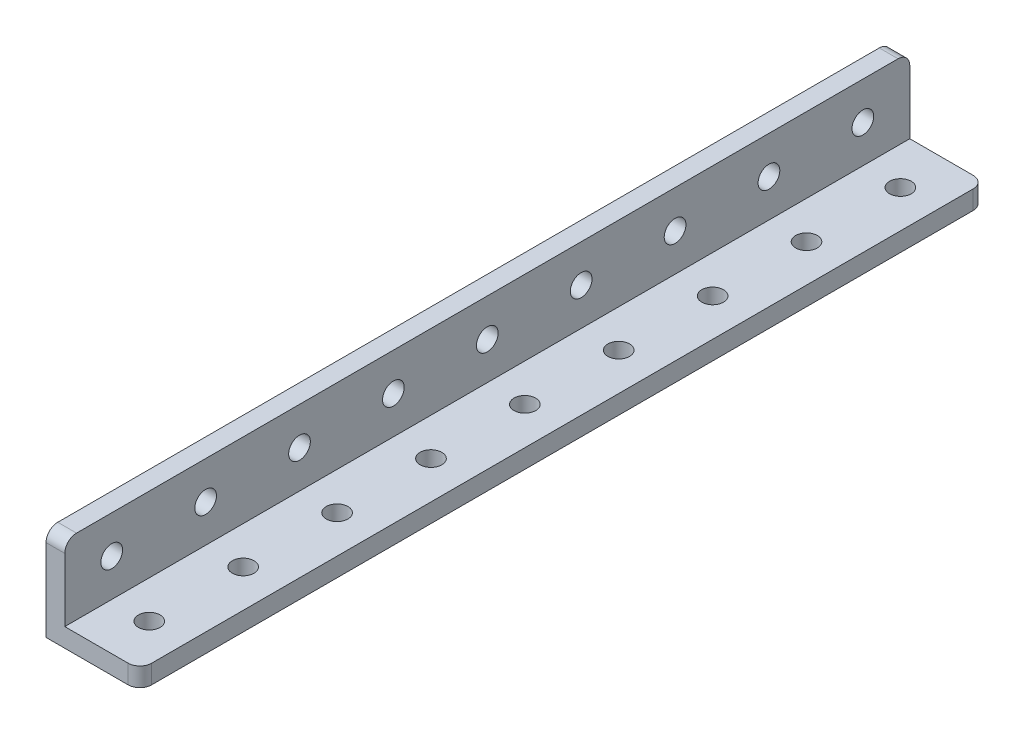
ISO-10303-21;
HEADER;
FILE_DESCRIPTION(('STEP AP214'),'2;1');
FILE_NAME('part.step','',(''),(''),'','','');
FILE_SCHEMA(('AUTOMOTIVE_DESIGN { 1 0 10303 214 1 1 1 1 }'));
ENDSEC;
DATA;
#1=APPLICATION_CONTEXT('core data for automotive mechanical design processes');
#2=APPLICATION_PROTOCOL_DEFINITION('international standard','automotive_design',2000,#1);
#3=PRODUCT_CONTEXT('',#1,'mechanical');
#4=PRODUCT('Part','Part','',(#3));
#5=PRODUCT_RELATED_PRODUCT_CATEGORY('part','',(#4));
#6=PRODUCT_DEFINITION_FORMATION('','',#4);
#7=PRODUCT_DEFINITION_CONTEXT('part definition',#1,'design');
#8=PRODUCT_DEFINITION('design','',#6,#7);
#9=PRODUCT_DEFINITION_SHAPE('','',#8);
#10=(LENGTH_UNIT() NAMED_UNIT(*) SI_UNIT(.MILLI.,.METRE.));
#11=(NAMED_UNIT(*) PLANE_ANGLE_UNIT() SI_UNIT($,.RADIAN.));
#12=(NAMED_UNIT(*) SI_UNIT($,.STERADIAN.) SOLID_ANGLE_UNIT());
#13=UNCERTAINTY_MEASURE_WITH_UNIT(LENGTH_MEASURE(1.E-05),#10,'distance_accuracy_value','');
#14=(GEOMETRIC_REPRESENTATION_CONTEXT(3) GLOBAL_UNCERTAINTY_ASSIGNED_CONTEXT((#13)) GLOBAL_UNIT_ASSIGNED_CONTEXT((#10,
#11,#12)) REPRESENTATION_CONTEXT('',''));
#15=CARTESIAN_POINT('',(0.,0.,0.));
#16=DIRECTION('',(0.,0.,1.));
#17=DIRECTION('',(1.,0.,0.));
#18=AXIS2_PLACEMENT_3D('',#15,#16,#17);
#19=CARTESIAN_POINT('',(0.,16.,0.));
#20=DIRECTION('',(0.,0.,1.));
#21=DIRECTION('',(1.,0.,0.));
#22=AXIS2_PLACEMENT_3D('',#19,#20,#21);
#23=PLANE('',#22);
#24=DIRECTION('',(0.,-1.,0.));
#25=VECTOR('',#24,1.);
#26=CARTESIAN_POINT('',(3.2,16.,0.));
#27=LINE('',#26,#25);
#28=CARTESIAN_POINT('',(3.2,14.,0.));
#29=VERTEX_POINT('',#28);
#30=CARTESIAN_POINT('',(3.2,3.2,0.));
#31=VERTEX_POINT('',#30);
#32=EDGE_CURVE('E126',#29,#31,#27,.T.);
#33=ORIENTED_EDGE('',*,*,#32,.F.);
#34=DIRECTION('',(1.,0.,0.));
#35=VECTOR('',#34,1.);
#36=CARTESIAN_POINT('',(0.,14.,0.));
#37=LINE('',#36,#35);
#38=CARTESIAN_POINT('',(0.,14.,0.));
#39=VERTEX_POINT('',#38);
#40=EDGE_CURVE('E189',#29,#39,#37,.F.);
#41=ORIENTED_EDGE('',*,*,#40,.T.);
#42=DIRECTION('',(0.,-1.,0.));
#43=VECTOR('',#42,1.);
#44=CARTESIAN_POINT('',(0.,16.,0.));
#45=LINE('',#44,#43);
#46=CARTESIAN_POINT('',(0.,0.,0.));
#47=VERTEX_POINT('',#46);
#48=EDGE_CURVE('E147',#39,#47,#45,.T.);
#49=ORIENTED_EDGE('',*,*,#48,.T.);
#50=DIRECTION('',(1.,0.,0.));
#51=VECTOR('',#50,1.);
#52=CARTESIAN_POINT('',(0.,0.,0.));
#53=LINE('',#52,#51);
#54=CARTESIAN_POINT('',(14.,0.,0.));
#55=VERTEX_POINT('',#54);
#56=EDGE_CURVE('E157',#47,#55,#53,.T.);
#57=ORIENTED_EDGE('',*,*,#56,.T.);
#58=DIRECTION('',(0.,-1.,0.));
#59=VECTOR('',#58,1.);
#60=CARTESIAN_POINT('',(14.,16.,0.));
#61=LINE('',#60,#59);
#62=CARTESIAN_POINT('',(14.,3.2,0.));
#63=VERTEX_POINT('',#62);
#64=EDGE_CURVE('E187',#55,#63,#61,.F.);
#65=ORIENTED_EDGE('',*,*,#64,.T.);
#66=DIRECTION('',(1.,0.,0.));
#67=VECTOR('',#66,1.);
#68=CARTESIAN_POINT('',(3.2,3.2,0.));
#69=LINE('',#68,#67);
#70=EDGE_CURVE('E120',#31,#63,#69,.T.);
#71=ORIENTED_EDGE('',*,*,#70,.F.);
#72=EDGE_LOOP('',(#33,#41,#49,#57,#65,#71));
#73=FACE_BOUND('',#72,.T.);
#74=ADVANCED_FACE('F32',(#73),#23,.T.);
#75=CARTESIAN_POINT('',(0.,16.,-144.));
#76=DIRECTION('',(0.,1.,0.));
#77=DIRECTION('',(0.,0.,1.));
#78=AXIS2_PLACEMENT_3D('',#75,#76,#77);
#79=PLANE('',#78);
#80=DIRECTION('',(0.,0.,1.));
#81=VECTOR('',#80,1.);
#82=CARTESIAN_POINT('',(3.2,16.,-144.));
#83=LINE('',#82,#81);
#84=CARTESIAN_POINT('',(3.2,16.,-142.));
#85=VERTEX_POINT('',#84);
#86=CARTESIAN_POINT('',(3.2,16.,-2.));
#87=VERTEX_POINT('',#86);
#88=EDGE_CURVE('E141',#85,#87,#83,.T.);
#89=ORIENTED_EDGE('',*,*,#88,.F.);
#90=DIRECTION('',(1.,0.,0.));
#91=VECTOR('',#90,1.);
#92=CARTESIAN_POINT('',(0.,16.,-142.));
#93=LINE('',#92,#91);
#94=CARTESIAN_POINT('',(0.,16.,-142.));
#95=VERTEX_POINT('',#94);
#96=EDGE_CURVE('E181',#85,#95,#93,.F.);
#97=ORIENTED_EDGE('',*,*,#96,.T.);
#98=DIRECTION('',(0.,0.,1.));
#99=VECTOR('',#98,1.);
#100=CARTESIAN_POINT('',(0.,16.,-144.));
#101=LINE('',#100,#99);
#102=CARTESIAN_POINT('',(0.,16.,-2.));
#103=VERTEX_POINT('',#102);
#104=EDGE_CURVE('E154',#95,#103,#101,.T.);
#105=ORIENTED_EDGE('',*,*,#104,.T.);
#106=DIRECTION('',(1.,0.,0.));
#107=VECTOR('',#106,1.);
#108=CARTESIAN_POINT('',(0.,16.,-2.));
#109=LINE('',#108,#107);
#110=EDGE_CURVE('E178',#103,#87,#109,.T.);
#111=ORIENTED_EDGE('',*,*,#110,.T.);
#112=EDGE_LOOP('',(#89,#97,#105,#111));
#113=FACE_BOUND('',#112,.T.);
#114=ADVANCED_FACE('F220',(#113),#79,.T.);
#115=CARTESIAN_POINT('',(0.,0.,-144.));
#116=DIRECTION('',(0.,0.,-1.));
#117=DIRECTION('',(-1.,0.,0.));
#118=AXIS2_PLACEMENT_3D('',#115,#116,#117);
#119=PLANE('',#118);
#120=DIRECTION('',(0.,1.,0.));
#121=VECTOR('',#120,1.);
#122=CARTESIAN_POINT('',(0.,0.,-144.));
#123=LINE('',#122,#121);
#124=CARTESIAN_POINT('',(0.,0.,-144.));
#125=VERTEX_POINT('',#124);
#126=CARTESIAN_POINT('',(0.,14.,-144.));
#127=VERTEX_POINT('',#126);
#128=EDGE_CURVE('E152',#125,#127,#123,.T.);
#129=ORIENTED_EDGE('',*,*,#128,.T.);
#130=DIRECTION('',(1.,0.,0.));
#131=VECTOR('',#130,1.);
#132=CARTESIAN_POINT('',(0.,14.,-144.));
#133=LINE('',#132,#131);
#134=CARTESIAN_POINT('',(3.2,14.,-144.));
#135=VERTEX_POINT('',#134);
#136=EDGE_CURVE('E118',#127,#135,#133,.T.);
#137=ORIENTED_EDGE('',*,*,#136,.T.);
#138=DIRECTION('',(0.,-1.,0.));
#139=VECTOR('',#138,1.);
#140=CARTESIAN_POINT('',(3.2,16.,-144.));
#141=LINE('',#140,#139);
#142=CARTESIAN_POINT('',(3.2,3.2,-144.));
#143=VERTEX_POINT('',#142);
#144=EDGE_CURVE('E110',#135,#143,#141,.T.);
#145=ORIENTED_EDGE('',*,*,#144,.T.);
#146=DIRECTION('',(1.,0.,0.));
#147=VECTOR('',#146,1.);
#148=CARTESIAN_POINT('',(3.2,3.2,-144.));
#149=LINE('',#148,#147);
#150=CARTESIAN_POINT('',(14.,3.2,-144.));
#151=VERTEX_POINT('',#150);
#152=EDGE_CURVE('E115',#143,#151,#149,.T.);
#153=ORIENTED_EDGE('',*,*,#152,.T.);
#154=DIRECTION('',(0.,1.,0.));
#155=VECTOR('',#154,1.);
#156=CARTESIAN_POINT('',(14.,0.,-144.));
#157=LINE('',#156,#155);
#158=CARTESIAN_POINT('',(14.,0.,-144.));
#159=VERTEX_POINT('',#158);
#160=EDGE_CURVE('E161',#151,#159,#157,.F.);
#161=ORIENTED_EDGE('',*,*,#160,.T.);
#162=DIRECTION('',(1.,0.,0.));
#163=VECTOR('',#162,1.);
#164=CARTESIAN_POINT('',(0.,0.,-144.));
#165=LINE('',#164,#163);
#166=EDGE_CURVE('E159',#125,#159,#165,.T.);
#167=ORIENTED_EDGE('',*,*,#166,.F.);
#168=EDGE_LOOP('',(#129,#137,#145,#153,#161,#167));
#169=FACE_BOUND('',#168,.T.);
#170=ADVANCED_FACE('F113',(#169),#119,.T.);
#171=CARTESIAN_POINT('',(0.,0.,0.));
#172=DIRECTION('',(0.,-1.,0.));
#173=DIRECTION('',(0.,0.,-1.));
#174=AXIS2_PLACEMENT_3D('',#171,#172,#173);
#175=PLANE('',#174);
#176=CARTESIAN_POINT('',(9.6,0.,-24.));
#177=DIRECTION('',(0.,-1.,0.));
#178=DIRECTION('',(0.,0.,-1.));
#179=AXIS2_PLACEMENT_3D('',#176,#177,#178);
#180=CIRCLE('',#179,1.84999999999999);
#181=CARTESIAN_POINT('',(9.6,0.,-25.85));
#182=VERTEX_POINT('',#181);
#183=EDGE_CURVE('E331',#182,#182,#180,.T.);
#184=ORIENTED_EDGE('',*,*,#183,.F.);
#185=EDGE_LOOP('',(#184));
#186=FACE_BOUND('',#185,.T.);
#187=CARTESIAN_POINT('',(9.6,0.,-40.));
#188=DIRECTION('',(0.,-1.,0.));
#189=DIRECTION('',(0.,0.,-1.));
#190=AXIS2_PLACEMENT_3D('',#187,#188,#189);
#191=CIRCLE('',#190,1.84999999999999);
#192=CARTESIAN_POINT('',(9.6,0.,-41.85));
#193=VERTEX_POINT('',#192);
#194=EDGE_CURVE('E335',#193,#193,#191,.T.);
#195=ORIENTED_EDGE('',*,*,#194,.F.);
#196=EDGE_LOOP('',(#195));
#197=FACE_BOUND('',#196,.T.);
#198=CARTESIAN_POINT('',(9.6,0.,-56.));
#199=DIRECTION('',(0.,-1.,0.));
#200=DIRECTION('',(0.,0.,-1.));
#201=AXIS2_PLACEMENT_3D('',#198,#199,#200);
#202=CIRCLE('',#201,1.84999999999999);
#203=CARTESIAN_POINT('',(9.6,0.,-57.85));
#204=VERTEX_POINT('',#203);
#205=EDGE_CURVE('E344',#204,#204,#202,.T.);
#206=ORIENTED_EDGE('',*,*,#205,.F.);
#207=EDGE_LOOP('',(#206));
#208=FACE_BOUND('',#207,.T.);
#209=CARTESIAN_POINT('',(9.6,0.,-72.));
#210=DIRECTION('',(0.,-1.,0.));
#211=DIRECTION('',(0.,0.,-1.));
#212=AXIS2_PLACEMENT_3D('',#209,#210,#211);
#213=CIRCLE('',#212,1.84999999999999);
#214=CARTESIAN_POINT('',(9.6,0.,-73.85));
#215=VERTEX_POINT('',#214);
#216=EDGE_CURVE('E350',#215,#215,#213,.T.);
#217=ORIENTED_EDGE('',*,*,#216,.F.);
#218=EDGE_LOOP('',(#217));
#219=FACE_BOUND('',#218,.T.);
#220=CARTESIAN_POINT('',(9.6,0.,-88.));
#221=DIRECTION('',(0.,-1.,0.));
#222=DIRECTION('',(0.,0.,-1.));
#223=AXIS2_PLACEMENT_3D('',#220,#221,#222);
#224=CIRCLE('',#223,1.84999999999999);
#225=CARTESIAN_POINT('',(9.6,0.,-89.85));
#226=VERTEX_POINT('',#225);
#227=EDGE_CURVE('E356',#226,#226,#224,.T.);
#228=ORIENTED_EDGE('',*,*,#227,.F.);
#229=EDGE_LOOP('',(#228));
#230=FACE_BOUND('',#229,.T.);
#231=CARTESIAN_POINT('',(9.6,0.,-104.));
#232=DIRECTION('',(0.,-1.,0.));
#233=DIRECTION('',(0.,0.,-1.));
#234=AXIS2_PLACEMENT_3D('',#231,#232,#233);
#235=CIRCLE('',#234,1.84999999999999);
#236=CARTESIAN_POINT('',(9.6,0.,-105.85));
#237=VERTEX_POINT('',#236);
#238=EDGE_CURVE('E362',#237,#237,#235,.T.);
#239=ORIENTED_EDGE('',*,*,#238,.F.);
#240=EDGE_LOOP('',(#239));
#241=FACE_BOUND('',#240,.T.);
#242=CARTESIAN_POINT('',(9.6,0.,-120.));
#243=DIRECTION('',(0.,-1.,0.));
#244=DIRECTION('',(0.,0.,-1.));
#245=AXIS2_PLACEMENT_3D('',#242,#243,#244);
#246=CIRCLE('',#245,1.84999999999999);
#247=CARTESIAN_POINT('',(9.6,0.,-121.85));
#248=VERTEX_POINT('',#247);
#249=EDGE_CURVE('E368',#248,#248,#246,.T.);
#250=ORIENTED_EDGE('',*,*,#249,.F.);
#251=EDGE_LOOP('',(#250));
#252=FACE_BOUND('',#251,.T.);
#253=CARTESIAN_POINT('',(9.6,0.,-136.));
#254=DIRECTION('',(0.,-1.,0.));
#255=DIRECTION('',(0.,0.,-1.));
#256=AXIS2_PLACEMENT_3D('',#253,#254,#255);
#257=CIRCLE('',#256,1.84999999999999);
#258=CARTESIAN_POINT('',(9.6,0.,-137.85));
#259=VERTEX_POINT('',#258);
#260=EDGE_CURVE('E374',#259,#259,#257,.T.);
#261=ORIENTED_EDGE('',*,*,#260,.F.);
#262=EDGE_LOOP('',(#261));
#263=FACE_BOUND('',#262,.T.);
#264=CARTESIAN_POINT('',(9.6,0.,-8.));
#265=DIRECTION('',(0.,-1.,0.));
#266=DIRECTION('',(0.,0.,-1.));
#267=AXIS2_PLACEMENT_3D('',#264,#265,#266);
#268=CIRCLE('',#267,1.84999999999999);
#269=CARTESIAN_POINT('',(9.6,0.,-9.84999999999999));
#270=VERTEX_POINT('',#269);
#271=EDGE_CURVE('E380',#270,#270,#268,.T.);
#272=ORIENTED_EDGE('',*,*,#271,.F.);
#273=EDGE_LOOP('',(#272));
#274=FACE_BOUND('',#273,.T.);
#275=ORIENTED_EDGE('',*,*,#166,.T.);
#276=CARTESIAN_POINT('',(14.,0.,-142.));
#277=DIRECTION('',(0.,-1.,0.));
#278=DIRECTION('',(0.,0.,-1.));
#279=AXIS2_PLACEMENT_3D('',#276,#277,#278);
#280=CIRCLE('',#279,2.);
#281=CARTESIAN_POINT('',(16.,0.,-142.));
#282=VERTEX_POINT('',#281);
#283=EDGE_CURVE('E11',#159,#282,#280,.T.);
#284=ORIENTED_EDGE('',*,*,#283,.T.);
#285=DIRECTION('',(0.,0.,-1.));
#286=VECTOR('',#285,1.);
#287=CARTESIAN_POINT('',(16.,0.,0.));
#288=LINE('',#287,#286);
#289=CARTESIAN_POINT('',(16.,0.,-2.));
#290=VERTEX_POINT('',#289);
#291=EDGE_CURVE('E144',#290,#282,#288,.T.);
#292=ORIENTED_EDGE('',*,*,#291,.F.);
#293=CARTESIAN_POINT('',(14.,0.,-2.));
#294=DIRECTION('',(0.,-1.,0.));
#295=DIRECTION('',(0.,0.,-1.));
#296=AXIS2_PLACEMENT_3D('',#293,#294,#295);
#297=CIRCLE('',#296,2.);
#298=EDGE_CURVE('E40',#290,#55,#297,.T.);
#299=ORIENTED_EDGE('',*,*,#298,.T.);
#300=ORIENTED_EDGE('',*,*,#56,.F.);
#301=DIRECTION('',(0.,0.,-1.));
#302=VECTOR('',#301,1.);
#303=CARTESIAN_POINT('',(0.,0.,0.));
#304=LINE('',#303,#302);
#305=EDGE_CURVE('E149',#47,#125,#304,.T.);
#306=ORIENTED_EDGE('',*,*,#305,.T.);
#307=EDGE_LOOP('',(#275,#284,#292,#299,#300,#306));
#308=FACE_BOUND('',#307,.T.);
#309=ADVANCED_FACE('F199',(#186,#197,#208,#219,#230,#241,#252,#263,#274,#308),#175,.T.);
#310=CARTESIAN_POINT('',(0.,0.,0.));
#311=DIRECTION('',(1.,0.,0.));
#312=DIRECTION('',(0.,0.,-1.));
#313=AXIS2_PLACEMENT_3D('',#310,#311,#312);
#314=PLANE('',#313);
#315=CARTESIAN_POINT('',(0.,9.6,-24.));
#316=DIRECTION('',(-1.,0.,0.));
#317=DIRECTION('',(0.,0.,1.));
#318=AXIS2_PLACEMENT_3D('',#315,#316,#317);
#319=CIRCLE('',#318,1.84999999999999);
#320=CARTESIAN_POINT('',(0.,9.6,-22.15));
#321=VERTEX_POINT('',#320);
#322=EDGE_CURVE('E386',#321,#321,#319,.T.);
#323=ORIENTED_EDGE('',*,*,#322,.F.);
#324=EDGE_LOOP('',(#323));
#325=FACE_BOUND('',#324,.T.);
#326=CARTESIAN_POINT('',(0.,9.6,-40.));
#327=DIRECTION('',(-1.,0.,0.));
#328=DIRECTION('',(0.,0.,1.));
#329=AXIS2_PLACEMENT_3D('',#326,#327,#328);
#330=CIRCLE('',#329,1.84999999999999);
#331=CARTESIAN_POINT('',(0.,9.6,-38.15));
#332=VERTEX_POINT('',#331);
#333=EDGE_CURVE('E392',#332,#332,#330,.T.);
#334=ORIENTED_EDGE('',*,*,#333,.F.);
#335=EDGE_LOOP('',(#334));
#336=FACE_BOUND('',#335,.T.);
#337=CARTESIAN_POINT('',(0.,9.6,-56.));
#338=DIRECTION('',(-1.,0.,0.));
#339=DIRECTION('',(0.,0.,1.));
#340=AXIS2_PLACEMENT_3D('',#337,#338,#339);
#341=CIRCLE('',#340,1.84999999999999);
#342=CARTESIAN_POINT('',(0.,9.6,-54.15));
#343=VERTEX_POINT('',#342);
#344=EDGE_CURVE('E398',#343,#343,#341,.T.);
#345=ORIENTED_EDGE('',*,*,#344,.F.);
#346=EDGE_LOOP('',(#345));
#347=FACE_BOUND('',#346,.T.);
#348=CARTESIAN_POINT('',(0.,9.6,-72.));
#349=DIRECTION('',(-1.,0.,0.));
#350=DIRECTION('',(0.,0.,1.));
#351=AXIS2_PLACEMENT_3D('',#348,#349,#350);
#352=CIRCLE('',#351,1.84999999999999);
#353=CARTESIAN_POINT('',(0.,9.6,-70.15));
#354=VERTEX_POINT('',#353);
#355=EDGE_CURVE('E171',#354,#354,#352,.T.);
#356=ORIENTED_EDGE('',*,*,#355,.F.);
#357=EDGE_LOOP('',(#356));
#358=FACE_BOUND('',#357,.T.);
#359=CARTESIAN_POINT('',(0.,9.6,-88.));
#360=DIRECTION('',(-1.,0.,0.));
#361=DIRECTION('',(0.,0.,1.));
#362=AXIS2_PLACEMENT_3D('',#359,#360,#361);
#363=CIRCLE('',#362,1.84999999999999);
#364=CARTESIAN_POINT('',(0.,9.6,-86.15));
#365=VERTEX_POINT('',#364);
#366=EDGE_CURVE('E170',#365,#365,#363,.T.);
#367=ORIENTED_EDGE('',*,*,#366,.F.);
#368=EDGE_LOOP('',(#367));
#369=FACE_BOUND('',#368,.T.);
#370=CARTESIAN_POINT('',(0.,9.6,-104.));
#371=DIRECTION('',(-1.,0.,0.));
#372=DIRECTION('',(0.,0.,1.));
#373=AXIS2_PLACEMENT_3D('',#370,#371,#372);
#374=CIRCLE('',#373,1.84999999999999);
#375=CARTESIAN_POINT('',(0.,9.6,-102.15));
#376=VERTEX_POINT('',#375);
#377=EDGE_CURVE('E411',#376,#376,#374,.T.);
#378=ORIENTED_EDGE('',*,*,#377,.F.);
#379=EDGE_LOOP('',(#378));
#380=FACE_BOUND('',#379,.T.);
#381=CARTESIAN_POINT('',(0.,9.6,-120.));
#382=DIRECTION('',(-1.,0.,0.));
#383=DIRECTION('',(0.,0.,1.));
#384=AXIS2_PLACEMENT_3D('',#381,#382,#383);
#385=CIRCLE('',#384,1.84999999999999);
#386=CARTESIAN_POINT('',(0.,9.6,-118.15));
#387=VERTEX_POINT('',#386);
#388=EDGE_CURVE('E417',#387,#387,#385,.T.);
#389=ORIENTED_EDGE('',*,*,#388,.F.);
#390=EDGE_LOOP('',(#389));
#391=FACE_BOUND('',#390,.T.);
#392=CARTESIAN_POINT('',(0.,9.6,-136.));
#393=DIRECTION('',(-1.,0.,0.));
#394=DIRECTION('',(0.,0.,1.));
#395=AXIS2_PLACEMENT_3D('',#392,#393,#394);
#396=CIRCLE('',#395,1.84999999999999);
#397=CARTESIAN_POINT('',(0.,9.6,-134.15));
#398=VERTEX_POINT('',#397);
#399=EDGE_CURVE('E423',#398,#398,#396,.T.);
#400=ORIENTED_EDGE('',*,*,#399,.F.);
#401=EDGE_LOOP('',(#400));
#402=FACE_BOUND('',#401,.T.);
#403=CARTESIAN_POINT('',(0.,9.6,-8.));
#404=DIRECTION('',(-1.,0.,0.));
#405=DIRECTION('',(0.,0.,1.));
#406=AXIS2_PLACEMENT_3D('',#403,#404,#405);
#407=CIRCLE('',#406,1.84999999999999);
#408=CARTESIAN_POINT('',(0.,9.6,-6.15000000000001));
#409=VERTEX_POINT('',#408);
#410=EDGE_CURVE('E166',#409,#409,#407,.T.);
#411=ORIENTED_EDGE('',*,*,#410,.F.);
#412=EDGE_LOOP('',(#411));
#413=FACE_BOUND('',#412,.T.);
#414=ORIENTED_EDGE('',*,*,#104,.F.);
#415=CARTESIAN_POINT('',(0.,14.,-142.));
#416=DIRECTION('',(1.,0.,0.));
#417=DIRECTION('',(0.,0.,-1.));
#418=AXIS2_PLACEMENT_3D('',#415,#416,#417);
#419=CIRCLE('',#418,2.);
#420=EDGE_CURVE('E185',#95,#127,#419,.F.);
#421=ORIENTED_EDGE('',*,*,#420,.T.);
#422=ORIENTED_EDGE('',*,*,#128,.F.);
#423=ORIENTED_EDGE('',*,*,#305,.F.);
#424=ORIENTED_EDGE('',*,*,#48,.F.);
#425=CARTESIAN_POINT('',(0.,14.,-2.));
#426=DIRECTION('',(1.,0.,0.));
#427=DIRECTION('',(0.,0.,-1.));
#428=AXIS2_PLACEMENT_3D('',#425,#426,#427);
#429=CIRCLE('',#428,2.);
#430=EDGE_CURVE('E183',#39,#103,#429,.F.);
#431=ORIENTED_EDGE('',*,*,#430,.T.);
#432=EDGE_LOOP('',(#414,#421,#422,#423,#424,#431));
#433=FACE_BOUND('',#432,.T.);
#434=ADVANCED_FACE('F212',(#325,#336,#347,#358,#369,#380,#391,#402,#413,#433),#314,.F.);
#435=CARTESIAN_POINT('',(16.,0.,0.));
#436=DIRECTION('',(1.,0.,0.));
#437=DIRECTION('',(0.,0.,-1.));
#438=AXIS2_PLACEMENT_3D('',#435,#436,#437);
#439=PLANE('',#438);
#440=ORIENTED_EDGE('',*,*,#291,.T.);
#441=DIRECTION('',(0.,1.,0.));
#442=VECTOR('',#441,1.);
#443=CARTESIAN_POINT('',(16.,0.,-142.));
#444=LINE('',#443,#442);
#445=CARTESIAN_POINT('',(16.,3.2,-142.));
#446=VERTEX_POINT('',#445);
#447=EDGE_CURVE('E193',#282,#446,#444,.T.);
#448=ORIENTED_EDGE('',*,*,#447,.T.);
#449=DIRECTION('',(0.,0.,1.));
#450=VECTOR('',#449,1.);
#451=CARTESIAN_POINT('',(16.,3.2,-144.));
#452=LINE('',#451,#450);
#453=CARTESIAN_POINT('',(16.,3.2,-2.));
#454=VERTEX_POINT('',#453);
#455=EDGE_CURVE('E130',#446,#454,#452,.T.);
#456=ORIENTED_EDGE('',*,*,#455,.T.);
#457=DIRECTION('',(0.,-1.,0.));
#458=VECTOR('',#457,1.);
#459=CARTESIAN_POINT('',(16.,0.,-2.));
#460=LINE('',#459,#458);
#461=EDGE_CURVE('E191',#454,#290,#460,.T.);
#462=ORIENTED_EDGE('',*,*,#461,.T.);
#463=EDGE_LOOP('',(#440,#448,#456,#462));
#464=FACE_BOUND('',#463,.T.);
#465=ADVANCED_FACE('F205',(#464),#439,.T.);
#466=CARTESIAN_POINT('',(3.2,16.,-144.));
#467=DIRECTION('',(-1.,0.,0.));
#468=DIRECTION('',(0.,-1.,0.));
#469=AXIS2_PLACEMENT_3D('',#466,#467,#468);
#470=PLANE('',#469);
#471=CARTESIAN_POINT('',(3.2,9.6,-24.));
#472=DIRECTION('',(-1.,0.,0.));
#473=DIRECTION('',(0.,-1.,0.));
#474=AXIS2_PLACEMENT_3D('',#471,#472,#473);
#475=CIRCLE('',#474,1.84999999999999);
#476=CARTESIAN_POINT('',(3.2,7.75000000000001,-24.));
#477=VERTEX_POINT('',#476);
#478=EDGE_CURVE('E389',#477,#477,#475,.T.);
#479=ORIENTED_EDGE('',*,*,#478,.T.);
#480=EDGE_LOOP('',(#479));
#481=FACE_BOUND('',#480,.T.);
#482=CARTESIAN_POINT('',(3.2,9.6,-40.));
#483=DIRECTION('',(-1.,0.,0.));
#484=DIRECTION('',(0.,-1.,0.));
#485=AXIS2_PLACEMENT_3D('',#482,#483,#484);
#486=CIRCLE('',#485,1.84999999999999);
#487=CARTESIAN_POINT('',(3.2,7.75000000000001,-40.));
#488=VERTEX_POINT('',#487);
#489=EDGE_CURVE('E395',#488,#488,#486,.T.);
#490=ORIENTED_EDGE('',*,*,#489,.T.);
#491=EDGE_LOOP('',(#490));
#492=FACE_BOUND('',#491,.T.);
#493=CARTESIAN_POINT('',(3.2,9.6,-56.));
#494=DIRECTION('',(-1.,0.,0.));
#495=DIRECTION('',(0.,-1.,0.));
#496=AXIS2_PLACEMENT_3D('',#493,#494,#495);
#497=CIRCLE('',#496,1.84999999999999);
#498=CARTESIAN_POINT('',(3.2,7.75000000000001,-56.));
#499=VERTEX_POINT('',#498);
#500=EDGE_CURVE('E401',#499,#499,#497,.T.);
#501=ORIENTED_EDGE('',*,*,#500,.T.);
#502=EDGE_LOOP('',(#501));
#503=FACE_BOUND('',#502,.T.);
#504=CARTESIAN_POINT('',(3.2,9.6,-72.));
#505=DIRECTION('',(-1.,0.,0.));
#506=DIRECTION('',(0.,-1.,0.));
#507=AXIS2_PLACEMENT_3D('',#504,#505,#506);
#508=CIRCLE('',#507,1.84999999999999);
#509=CARTESIAN_POINT('',(3.2,7.75000000000001,-72.));
#510=VERTEX_POINT('',#509);
#511=EDGE_CURVE('E167',#510,#510,#508,.T.);
#512=ORIENTED_EDGE('',*,*,#511,.T.);
#513=EDGE_LOOP('',(#512));
#514=FACE_BOUND('',#513,.T.);
#515=CARTESIAN_POINT('',(3.2,9.6,-88.));
#516=DIRECTION('',(-1.,0.,0.));
#517=DIRECTION('',(0.,-1.,0.));
#518=AXIS2_PLACEMENT_3D('',#515,#516,#517);
#519=CIRCLE('',#518,1.84999999999999);
#520=CARTESIAN_POINT('',(3.2,7.75000000000001,-88.));
#521=VERTEX_POINT('',#520);
#522=EDGE_CURVE('E408',#521,#521,#519,.T.);
#523=ORIENTED_EDGE('',*,*,#522,.T.);
#524=EDGE_LOOP('',(#523));
#525=FACE_BOUND('',#524,.T.);
#526=CARTESIAN_POINT('',(3.2,9.6,-104.));
#527=DIRECTION('',(-1.,0.,0.));
#528=DIRECTION('',(0.,-1.,0.));
#529=AXIS2_PLACEMENT_3D('',#526,#527,#528);
#530=CIRCLE('',#529,1.84999999999999);
#531=CARTESIAN_POINT('',(3.2,7.75000000000001,-104.));
#532=VERTEX_POINT('',#531);
#533=EDGE_CURVE('E414',#532,#532,#530,.T.);
#534=ORIENTED_EDGE('',*,*,#533,.T.);
#535=EDGE_LOOP('',(#534));
#536=FACE_BOUND('',#535,.T.);
#537=CARTESIAN_POINT('',(3.2,9.6,-120.));
#538=DIRECTION('',(-1.,0.,0.));
#539=DIRECTION('',(0.,-1.,0.));
#540=AXIS2_PLACEMENT_3D('',#537,#538,#539);
#541=CIRCLE('',#540,1.84999999999999);
#542=CARTESIAN_POINT('',(3.2,7.75000000000001,-120.));
#543=VERTEX_POINT('',#542);
#544=EDGE_CURVE('E420',#543,#543,#541,.T.);
#545=ORIENTED_EDGE('',*,*,#544,.T.);
#546=EDGE_LOOP('',(#545));
#547=FACE_BOUND('',#546,.T.);
#548=CARTESIAN_POINT('',(3.2,9.6,-136.));
#549=DIRECTION('',(-1.,0.,0.));
#550=DIRECTION('',(0.,-1.,0.));
#551=AXIS2_PLACEMENT_3D('',#548,#549,#550);
#552=CIRCLE('',#551,1.84999999999999);
#553=CARTESIAN_POINT('',(3.2,7.75000000000001,-136.));
#554=VERTEX_POINT('',#553);
#555=EDGE_CURVE('E426',#554,#554,#552,.T.);
#556=ORIENTED_EDGE('',*,*,#555,.T.);
#557=EDGE_LOOP('',(#556));
#558=FACE_BOUND('',#557,.T.);
#559=CARTESIAN_POINT('',(3.2,9.6,-8.));
#560=DIRECTION('',(-1.,0.,0.));
#561=DIRECTION('',(0.,-1.,0.));
#562=AXIS2_PLACEMENT_3D('',#559,#560,#561);
#563=CIRCLE('',#562,1.84999999999999);
#564=CARTESIAN_POINT('',(3.2,7.75000000000001,-8.));
#565=VERTEX_POINT('',#564);
#566=EDGE_CURVE('E139',#565,#565,#563,.T.);
#567=ORIENTED_EDGE('',*,*,#566,.T.);
#568=EDGE_LOOP('',(#567));
#569=FACE_BOUND('',#568,.T.);
#570=ORIENTED_EDGE('',*,*,#144,.F.);
#571=CARTESIAN_POINT('',(3.2,14.,-142.));
#572=DIRECTION('',(-1.,0.,0.));
#573=DIRECTION('',(0.,-1.,0.));
#574=AXIS2_PLACEMENT_3D('',#571,#572,#573);
#575=CIRCLE('',#574,2.);
#576=EDGE_CURVE('E176',#135,#85,#575,.F.);
#577=ORIENTED_EDGE('',*,*,#576,.T.);
#578=ORIENTED_EDGE('',*,*,#88,.T.);
#579=CARTESIAN_POINT('',(3.2,14.,-2.));
#580=DIRECTION('',(-1.,0.,0.));
#581=DIRECTION('',(0.,-1.,0.));
#582=AXIS2_PLACEMENT_3D('',#579,#580,#581);
#583=CIRCLE('',#582,2.);
#584=EDGE_CURVE('E174',#87,#29,#583,.F.);
#585=ORIENTED_EDGE('',*,*,#584,.T.);
#586=ORIENTED_EDGE('',*,*,#32,.T.);
#587=DIRECTION('',(0.,0.,1.));
#588=VECTOR('',#587,1.);
#589=CARTESIAN_POINT('',(3.2,3.2,-144.));
#590=LINE('',#589,#588);
#591=EDGE_CURVE('E123',#143,#31,#590,.T.);
#592=ORIENTED_EDGE('',*,*,#591,.F.);
#593=EDGE_LOOP('',(#570,#577,#578,#585,#586,#592));
#594=FACE_BOUND('',#593,.T.);
#595=ADVANCED_FACE('F124',(#481,#492,#503,#514,#525,#536,#547,#558,#569,#594),#470,.F.);
#596=CARTESIAN_POINT('',(3.2,3.2,-144.));
#597=DIRECTION('',(0.,-1.,0.));
#598=DIRECTION('',(0.,0.,-1.));
#599=AXIS2_PLACEMENT_3D('',#596,#597,#598);
#600=PLANE('',#599);
#601=CARTESIAN_POINT('',(9.6,3.2,-24.));
#602=DIRECTION('',(0.,-1.,0.));
#603=DIRECTION('',(0.,0.,-1.));
#604=AXIS2_PLACEMENT_3D('',#601,#602,#603);
#605=CIRCLE('',#604,1.84999999999999);
#606=CARTESIAN_POINT('',(9.6,3.2,-25.85));
#607=VERTEX_POINT('',#606);
#608=EDGE_CURVE('E334',#607,#607,#605,.T.);
#609=ORIENTED_EDGE('',*,*,#608,.T.);
#610=EDGE_LOOP('',(#609));
#611=FACE_BOUND('',#610,.T.);
#612=CARTESIAN_POINT('',(9.6,3.2,-40.));
#613=DIRECTION('',(0.,-1.,0.));
#614=DIRECTION('',(0.,0.,-1.));
#615=AXIS2_PLACEMENT_3D('',#612,#613,#614);
#616=CIRCLE('',#615,1.84999999999999);
#617=CARTESIAN_POINT('',(9.6,3.2,-41.85));
#618=VERTEX_POINT('',#617);
#619=EDGE_CURVE('E338',#618,#618,#616,.T.);
#620=ORIENTED_EDGE('',*,*,#619,.T.);
#621=EDGE_LOOP('',(#620));
#622=FACE_BOUND('',#621,.T.);
#623=CARTESIAN_POINT('',(9.6,3.2,-56.));
#624=DIRECTION('',(0.,-1.,0.));
#625=DIRECTION('',(0.,0.,-1.));
#626=AXIS2_PLACEMENT_3D('',#623,#624,#625);
#627=CIRCLE('',#626,1.84999999999999);
#628=CARTESIAN_POINT('',(9.6,3.2,-57.85));
#629=VERTEX_POINT('',#628);
#630=EDGE_CURVE('E347',#629,#629,#627,.T.);
#631=ORIENTED_EDGE('',*,*,#630,.T.);
#632=EDGE_LOOP('',(#631));
#633=FACE_BOUND('',#632,.T.);
#634=CARTESIAN_POINT('',(9.6,3.2,-72.));
#635=DIRECTION('',(0.,-1.,0.));
#636=DIRECTION('',(0.,0.,-1.));
#637=AXIS2_PLACEMENT_3D('',#634,#635,#636);
#638=CIRCLE('',#637,1.84999999999999);
#639=CARTESIAN_POINT('',(9.6,3.2,-73.85));
#640=VERTEX_POINT('',#639);
#641=EDGE_CURVE('E353',#640,#640,#638,.T.);
#642=ORIENTED_EDGE('',*,*,#641,.T.);
#643=EDGE_LOOP('',(#642));
#644=FACE_BOUND('',#643,.T.);
#645=CARTESIAN_POINT('',(9.6,3.2,-88.));
#646=DIRECTION('',(0.,-1.,0.));
#647=DIRECTION('',(0.,0.,-1.));
#648=AXIS2_PLACEMENT_3D('',#645,#646,#647);
#649=CIRCLE('',#648,1.84999999999999);
#650=CARTESIAN_POINT('',(9.6,3.2,-89.85));
#651=VERTEX_POINT('',#650);
#652=EDGE_CURVE('E359',#651,#651,#649,.T.);
#653=ORIENTED_EDGE('',*,*,#652,.T.);
#654=EDGE_LOOP('',(#653));
#655=FACE_BOUND('',#654,.T.);
#656=CARTESIAN_POINT('',(9.6,3.2,-104.));
#657=DIRECTION('',(0.,-1.,0.));
#658=DIRECTION('',(0.,0.,-1.));
#659=AXIS2_PLACEMENT_3D('',#656,#657,#658);
#660=CIRCLE('',#659,1.84999999999999);
#661=CARTESIAN_POINT('',(9.6,3.2,-105.85));
#662=VERTEX_POINT('',#661);
#663=EDGE_CURVE('E365',#662,#662,#660,.T.);
#664=ORIENTED_EDGE('',*,*,#663,.T.);
#665=EDGE_LOOP('',(#664));
#666=FACE_BOUND('',#665,.T.);
#667=CARTESIAN_POINT('',(9.6,3.2,-120.));
#668=DIRECTION('',(0.,-1.,0.));
#669=DIRECTION('',(0.,0.,-1.));
#670=AXIS2_PLACEMENT_3D('',#667,#668,#669);
#671=CIRCLE('',#670,1.84999999999999);
#672=CARTESIAN_POINT('',(9.6,3.2,-121.85));
#673=VERTEX_POINT('',#672);
#674=EDGE_CURVE('E371',#673,#673,#671,.T.);
#675=ORIENTED_EDGE('',*,*,#674,.T.);
#676=EDGE_LOOP('',(#675));
#677=FACE_BOUND('',#676,.T.);
#678=CARTESIAN_POINT('',(9.6,3.2,-136.));
#679=DIRECTION('',(0.,-1.,0.));
#680=DIRECTION('',(0.,0.,-1.));
#681=AXIS2_PLACEMENT_3D('',#678,#679,#680);
#682=CIRCLE('',#681,1.84999999999999);
#683=CARTESIAN_POINT('',(9.6,3.2,-137.85));
#684=VERTEX_POINT('',#683);
#685=EDGE_CURVE('E377',#684,#684,#682,.T.);
#686=ORIENTED_EDGE('',*,*,#685,.T.);
#687=EDGE_LOOP('',(#686));
#688=FACE_BOUND('',#687,.T.);
#689=CARTESIAN_POINT('',(9.6,3.2,-8.));
#690=DIRECTION('',(0.,-1.,0.));
#691=DIRECTION('',(0.,0.,-1.));
#692=AXIS2_PLACEMENT_3D('',#689,#690,#691);
#693=CIRCLE('',#692,1.84999999999999);
#694=CARTESIAN_POINT('',(9.6,3.2,-9.84999999999999));
#695=VERTEX_POINT('',#694);
#696=EDGE_CURVE('E383',#695,#695,#693,.T.);
#697=ORIENTED_EDGE('',*,*,#696,.T.);
#698=EDGE_LOOP('',(#697));
#699=FACE_BOUND('',#698,.T.);
#700=ORIENTED_EDGE('',*,*,#455,.F.);
#701=CARTESIAN_POINT('',(14.,3.2,-142.));
#702=DIRECTION('',(0.,-1.,0.));
#703=DIRECTION('',(0.,0.,-1.));
#704=AXIS2_PLACEMENT_3D('',#701,#702,#703);
#705=CIRCLE('',#704,2.);
#706=EDGE_CURVE('E134',#446,#151,#705,.F.);
#707=ORIENTED_EDGE('',*,*,#706,.T.);
#708=ORIENTED_EDGE('',*,*,#152,.F.);
#709=ORIENTED_EDGE('',*,*,#591,.T.);
#710=ORIENTED_EDGE('',*,*,#70,.T.);
#711=CARTESIAN_POINT('',(14.,3.2,-2.));
#712=DIRECTION('',(0.,-1.,0.));
#713=DIRECTION('',(0.,0.,-1.));
#714=AXIS2_PLACEMENT_3D('',#711,#712,#713);
#715=CIRCLE('',#714,2.);
#716=EDGE_CURVE('E196',#63,#454,#715,.F.);
#717=ORIENTED_EDGE('',*,*,#716,.T.);
#718=EDGE_LOOP('',(#700,#707,#708,#709,#710,#717));
#719=FACE_BOUND('',#718,.T.);
#720=ADVANCED_FACE('F133',(#611,#622,#633,#644,#655,#666,#677,#688,#699,#719),#600,.F.);
#721=CARTESIAN_POINT('',(0.,9.6,-8.));
#722=DIRECTION('',(-1.,0.,0.));
#723=DIRECTION('',(0.,0.,1.));
#724=AXIS2_PLACEMENT_3D('',#721,#722,#723);
#725=CYLINDRICAL_SURFACE('',#724,1.84999999999999);
#726=ORIENTED_EDGE('',*,*,#410,.T.);
#727=EDGE_LOOP('',(#726));
#728=FACE_BOUND('',#727,.T.);
#729=ORIENTED_EDGE('',*,*,#566,.F.);
#730=EDGE_LOOP('',(#729));
#731=FACE_BOUND('',#730,.T.);
#732=ADVANCED_FACE('F255',(#728,#731),#725,.F.);
#733=CARTESIAN_POINT('',(0.,9.6,-136.));
#734=DIRECTION('',(-1.,0.,0.));
#735=DIRECTION('',(0.,0.,1.));
#736=AXIS2_PLACEMENT_3D('',#733,#734,#735);
#737=CYLINDRICAL_SURFACE('',#736,1.84999999999999);
#738=ORIENTED_EDGE('',*,*,#399,.T.);
#739=EDGE_LOOP('',(#738));
#740=FACE_BOUND('',#739,.T.);
#741=ORIENTED_EDGE('',*,*,#555,.F.);
#742=EDGE_LOOP('',(#741));
#743=FACE_BOUND('',#742,.T.);
#744=ADVANCED_FACE('F259',(#740,#743),#737,.F.);
#745=CARTESIAN_POINT('',(0.,9.6,-120.));
#746=DIRECTION('',(-1.,0.,0.));
#747=DIRECTION('',(0.,0.,1.));
#748=AXIS2_PLACEMENT_3D('',#745,#746,#747);
#749=CYLINDRICAL_SURFACE('',#748,1.84999999999999);
#750=ORIENTED_EDGE('',*,*,#388,.T.);
#751=EDGE_LOOP('',(#750));
#752=FACE_BOUND('',#751,.T.);
#753=ORIENTED_EDGE('',*,*,#544,.F.);
#754=EDGE_LOOP('',(#753));
#755=FACE_BOUND('',#754,.T.);
#756=ADVANCED_FACE('F263',(#752,#755),#749,.F.);
#757=CARTESIAN_POINT('',(0.,9.6,-104.));
#758=DIRECTION('',(-1.,0.,0.));
#759=DIRECTION('',(0.,0.,1.));
#760=AXIS2_PLACEMENT_3D('',#757,#758,#759);
#761=CYLINDRICAL_SURFACE('',#760,1.84999999999999);
#762=ORIENTED_EDGE('',*,*,#377,.T.);
#763=EDGE_LOOP('',(#762));
#764=FACE_BOUND('',#763,.T.);
#765=ORIENTED_EDGE('',*,*,#533,.F.);
#766=EDGE_LOOP('',(#765));
#767=FACE_BOUND('',#766,.T.);
#768=ADVANCED_FACE('F267',(#764,#767),#761,.F.);
#769=CARTESIAN_POINT('',(0.,9.6,-88.));
#770=DIRECTION('',(-1.,0.,0.));
#771=DIRECTION('',(0.,0.,1.));
#772=AXIS2_PLACEMENT_3D('',#769,#770,#771);
#773=CYLINDRICAL_SURFACE('',#772,1.84999999999999);
#774=ORIENTED_EDGE('',*,*,#366,.T.);
#775=EDGE_LOOP('',(#774));
#776=FACE_BOUND('',#775,.T.);
#777=ORIENTED_EDGE('',*,*,#522,.F.);
#778=EDGE_LOOP('',(#777));
#779=FACE_BOUND('',#778,.T.);
#780=ADVANCED_FACE('F271',(#776,#779),#773,.F.);
#781=CARTESIAN_POINT('',(0.,9.6,-72.));
#782=DIRECTION('',(-1.,0.,0.));
#783=DIRECTION('',(0.,0.,1.));
#784=AXIS2_PLACEMENT_3D('',#781,#782,#783);
#785=CYLINDRICAL_SURFACE('',#784,1.84999999999999);
#786=ORIENTED_EDGE('',*,*,#355,.T.);
#787=EDGE_LOOP('',(#786));
#788=FACE_BOUND('',#787,.T.);
#789=ORIENTED_EDGE('',*,*,#511,.F.);
#790=EDGE_LOOP('',(#789));
#791=FACE_BOUND('',#790,.T.);
#792=ADVANCED_FACE('F275',(#788,#791),#785,.F.);
#793=CARTESIAN_POINT('',(0.,9.6,-56.));
#794=DIRECTION('',(-1.,0.,0.));
#795=DIRECTION('',(0.,0.,1.));
#796=AXIS2_PLACEMENT_3D('',#793,#794,#795);
#797=CYLINDRICAL_SURFACE('',#796,1.84999999999999);
#798=ORIENTED_EDGE('',*,*,#344,.T.);
#799=EDGE_LOOP('',(#798));
#800=FACE_BOUND('',#799,.T.);
#801=ORIENTED_EDGE('',*,*,#500,.F.);
#802=EDGE_LOOP('',(#801));
#803=FACE_BOUND('',#802,.T.);
#804=ADVANCED_FACE('F279',(#800,#803),#797,.F.);
#805=CARTESIAN_POINT('',(0.,9.6,-40.));
#806=DIRECTION('',(-1.,0.,0.));
#807=DIRECTION('',(0.,0.,1.));
#808=AXIS2_PLACEMENT_3D('',#805,#806,#807);
#809=CYLINDRICAL_SURFACE('',#808,1.84999999999999);
#810=ORIENTED_EDGE('',*,*,#333,.T.);
#811=EDGE_LOOP('',(#810));
#812=FACE_BOUND('',#811,.T.);
#813=ORIENTED_EDGE('',*,*,#489,.F.);
#814=EDGE_LOOP('',(#813));
#815=FACE_BOUND('',#814,.T.);
#816=ADVANCED_FACE('F283',(#812,#815),#809,.F.);
#817=CARTESIAN_POINT('',(0.,9.6,-24.));
#818=DIRECTION('',(-1.,0.,0.));
#819=DIRECTION('',(0.,0.,1.));
#820=AXIS2_PLACEMENT_3D('',#817,#818,#819);
#821=CYLINDRICAL_SURFACE('',#820,1.84999999999999);
#822=ORIENTED_EDGE('',*,*,#322,.T.);
#823=EDGE_LOOP('',(#822));
#824=FACE_BOUND('',#823,.T.);
#825=ORIENTED_EDGE('',*,*,#478,.F.);
#826=EDGE_LOOP('',(#825));
#827=FACE_BOUND('',#826,.T.);
#828=ADVANCED_FACE('F287',(#824,#827),#821,.F.);
#829=CARTESIAN_POINT('',(9.6,0.,-8.));
#830=DIRECTION('',(0.,-1.,0.));
#831=DIRECTION('',(0.,0.,-1.));
#832=AXIS2_PLACEMENT_3D('',#829,#830,#831);
#833=CYLINDRICAL_SURFACE('',#832,1.84999999999999);
#834=ORIENTED_EDGE('',*,*,#271,.T.);
#835=EDGE_LOOP('',(#834));
#836=FACE_BOUND('',#835,.T.);
#837=ORIENTED_EDGE('',*,*,#696,.F.);
#838=EDGE_LOOP('',(#837));
#839=FACE_BOUND('',#838,.T.);
#840=ADVANCED_FACE('F291',(#836,#839),#833,.F.);
#841=CARTESIAN_POINT('',(9.6,0.,-136.));
#842=DIRECTION('',(0.,-1.,0.));
#843=DIRECTION('',(0.,0.,-1.));
#844=AXIS2_PLACEMENT_3D('',#841,#842,#843);
#845=CYLINDRICAL_SURFACE('',#844,1.84999999999999);
#846=ORIENTED_EDGE('',*,*,#260,.T.);
#847=EDGE_LOOP('',(#846));
#848=FACE_BOUND('',#847,.T.);
#849=ORIENTED_EDGE('',*,*,#685,.F.);
#850=EDGE_LOOP('',(#849));
#851=FACE_BOUND('',#850,.T.);
#852=ADVANCED_FACE('F295',(#848,#851),#845,.F.);
#853=CARTESIAN_POINT('',(9.6,0.,-120.));
#854=DIRECTION('',(0.,-1.,0.));
#855=DIRECTION('',(0.,0.,-1.));
#856=AXIS2_PLACEMENT_3D('',#853,#854,#855);
#857=CYLINDRICAL_SURFACE('',#856,1.84999999999999);
#858=ORIENTED_EDGE('',*,*,#249,.T.);
#859=EDGE_LOOP('',(#858));
#860=FACE_BOUND('',#859,.T.);
#861=ORIENTED_EDGE('',*,*,#674,.F.);
#862=EDGE_LOOP('',(#861));
#863=FACE_BOUND('',#862,.T.);
#864=ADVANCED_FACE('F299',(#860,#863),#857,.F.);
#865=CARTESIAN_POINT('',(9.6,0.,-104.));
#866=DIRECTION('',(0.,-1.,0.));
#867=DIRECTION('',(0.,0.,-1.));
#868=AXIS2_PLACEMENT_3D('',#865,#866,#867);
#869=CYLINDRICAL_SURFACE('',#868,1.84999999999999);
#870=ORIENTED_EDGE('',*,*,#238,.T.);
#871=EDGE_LOOP('',(#870));
#872=FACE_BOUND('',#871,.T.);
#873=ORIENTED_EDGE('',*,*,#663,.F.);
#874=EDGE_LOOP('',(#873));
#875=FACE_BOUND('',#874,.T.);
#876=ADVANCED_FACE('F303',(#872,#875),#869,.F.);
#877=CARTESIAN_POINT('',(9.6,0.,-88.));
#878=DIRECTION('',(0.,-1.,0.));
#879=DIRECTION('',(0.,0.,-1.));
#880=AXIS2_PLACEMENT_3D('',#877,#878,#879);
#881=CYLINDRICAL_SURFACE('',#880,1.84999999999999);
#882=ORIENTED_EDGE('',*,*,#227,.T.);
#883=EDGE_LOOP('',(#882));
#884=FACE_BOUND('',#883,.T.);
#885=ORIENTED_EDGE('',*,*,#652,.F.);
#886=EDGE_LOOP('',(#885));
#887=FACE_BOUND('',#886,.T.);
#888=ADVANCED_FACE('F307',(#884,#887),#881,.F.);
#889=CARTESIAN_POINT('',(9.6,0.,-72.));
#890=DIRECTION('',(0.,-1.,0.));
#891=DIRECTION('',(0.,0.,-1.));
#892=AXIS2_PLACEMENT_3D('',#889,#890,#891);
#893=CYLINDRICAL_SURFACE('',#892,1.84999999999999);
#894=ORIENTED_EDGE('',*,*,#216,.T.);
#895=EDGE_LOOP('',(#894));
#896=FACE_BOUND('',#895,.T.);
#897=ORIENTED_EDGE('',*,*,#641,.F.);
#898=EDGE_LOOP('',(#897));
#899=FACE_BOUND('',#898,.T.);
#900=ADVANCED_FACE('F311',(#896,#899),#893,.F.);
#901=CARTESIAN_POINT('',(9.6,0.,-56.));
#902=DIRECTION('',(0.,-1.,0.));
#903=DIRECTION('',(0.,0.,-1.));
#904=AXIS2_PLACEMENT_3D('',#901,#902,#903);
#905=CYLINDRICAL_SURFACE('',#904,1.84999999999999);
#906=ORIENTED_EDGE('',*,*,#205,.T.);
#907=EDGE_LOOP('',(#906));
#908=FACE_BOUND('',#907,.T.);
#909=ORIENTED_EDGE('',*,*,#630,.F.);
#910=EDGE_LOOP('',(#909));
#911=FACE_BOUND('',#910,.T.);
#912=ADVANCED_FACE('F315',(#908,#911),#905,.F.);
#913=CARTESIAN_POINT('',(9.6,0.,-40.));
#914=DIRECTION('',(0.,-1.,0.));
#915=DIRECTION('',(0.,0.,-1.));
#916=AXIS2_PLACEMENT_3D('',#913,#914,#915);
#917=CYLINDRICAL_SURFACE('',#916,1.84999999999999);
#918=ORIENTED_EDGE('',*,*,#194,.T.);
#919=EDGE_LOOP('',(#918));
#920=FACE_BOUND('',#919,.T.);
#921=ORIENTED_EDGE('',*,*,#619,.F.);
#922=EDGE_LOOP('',(#921));
#923=FACE_BOUND('',#922,.T.);
#924=ADVANCED_FACE('F319',(#920,#923),#917,.F.);
#925=CARTESIAN_POINT('',(9.6,0.,-24.));
#926=DIRECTION('',(0.,-1.,0.));
#927=DIRECTION('',(0.,0.,-1.));
#928=AXIS2_PLACEMENT_3D('',#925,#926,#927);
#929=CYLINDRICAL_SURFACE('',#928,1.84999999999999);
#930=ORIENTED_EDGE('',*,*,#183,.T.);
#931=EDGE_LOOP('',(#930));
#932=FACE_BOUND('',#931,.T.);
#933=ORIENTED_EDGE('',*,*,#608,.F.);
#934=EDGE_LOOP('',(#933));
#935=FACE_BOUND('',#934,.T.);
#936=ADVANCED_FACE('F231',(#932,#935),#929,.F.);
#937=CARTESIAN_POINT('',(0.,14.,-142.));
#938=DIRECTION('',(1.,0.,0.));
#939=DIRECTION('',(0.,0.,-1.));
#940=AXIS2_PLACEMENT_3D('',#937,#938,#939);
#941=CYLINDRICAL_SURFACE('',#940,2.);
#942=ORIENTED_EDGE('',*,*,#420,.F.);
#943=ORIENTED_EDGE('',*,*,#96,.F.);
#944=ORIENTED_EDGE('',*,*,#576,.F.);
#945=ORIENTED_EDGE('',*,*,#136,.F.);
#946=EDGE_LOOP('',(#942,#943,#944,#945));
#947=FACE_BOUND('',#946,.T.);
#948=ADVANCED_FACE('F216',(#947),#941,.T.);
#949=CARTESIAN_POINT('',(0.,14.,-2.));
#950=DIRECTION('',(1.,0.,0.));
#951=DIRECTION('',(0.,0.,-1.));
#952=AXIS2_PLACEMENT_3D('',#949,#950,#951);
#953=CYLINDRICAL_SURFACE('',#952,2.);
#954=ORIENTED_EDGE('',*,*,#430,.F.);
#955=ORIENTED_EDGE('',*,*,#40,.F.);
#956=ORIENTED_EDGE('',*,*,#584,.F.);
#957=ORIENTED_EDGE('',*,*,#110,.F.);
#958=EDGE_LOOP('',(#954,#955,#956,#957));
#959=FACE_BOUND('',#958,.T.);
#960=ADVANCED_FACE('F223',(#959),#953,.T.);
#961=CARTESIAN_POINT('',(14.,0.,-142.));
#962=DIRECTION('',(0.,1.,0.));
#963=DIRECTION('',(0.,0.,1.));
#964=AXIS2_PLACEMENT_3D('',#961,#962,#963);
#965=CYLINDRICAL_SURFACE('',#964,2.);
#966=ORIENTED_EDGE('',*,*,#283,.F.);
#967=ORIENTED_EDGE('',*,*,#160,.F.);
#968=ORIENTED_EDGE('',*,*,#706,.F.);
#969=ORIENTED_EDGE('',*,*,#447,.F.);
#970=EDGE_LOOP('',(#966,#967,#968,#969));
#971=FACE_BOUND('',#970,.T.);
#972=ADVANCED_FACE('F208',(#971),#965,.T.);
#973=CARTESIAN_POINT('',(14.,0.,-2.));
#974=DIRECTION('',(0.,-1.,0.));
#975=DIRECTION('',(0.,0.,-1.));
#976=AXIS2_PLACEMENT_3D('',#973,#974,#975);
#977=CYLINDRICAL_SURFACE('',#976,2.);
#978=ORIENTED_EDGE('',*,*,#716,.F.);
#979=ORIENTED_EDGE('',*,*,#64,.F.);
#980=ORIENTED_EDGE('',*,*,#298,.F.);
#981=ORIENTED_EDGE('',*,*,#461,.F.);
#982=EDGE_LOOP('',(#978,#979,#980,#981));
#983=FACE_BOUND('',#982,.T.);
#984=ADVANCED_FACE('F34',(#983),#977,.T.);
#985=CLOSED_SHELL('',(#74,#114,#170,#309,#434,#465,#595,#720,#732,#744,#756,#768,#780,#792,#804,
#816,#828,#840,#852,#864,#876,#888,#900,#912,#924,#936,#948,#960,#972,#984));
#986=MANIFOLD_SOLID_BREP('B2',#985);
#987=ADVANCED_BREP_SHAPE_REPRESENTATION('',(#18,#986),#14);
#988=SHAPE_DEFINITION_REPRESENTATION(#9,#987);
ENDSEC;
END-ISO-10303-21;
